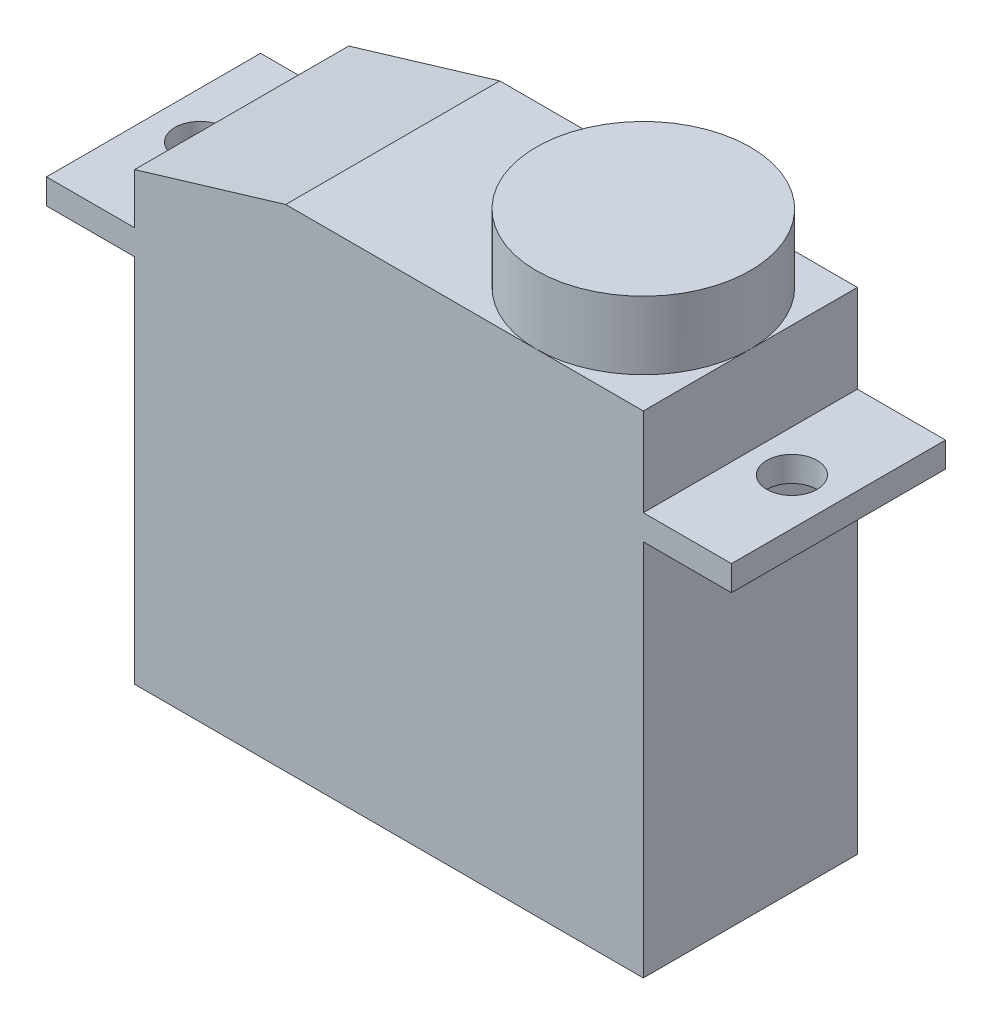
ISO-10303-21;
HEADER;
FILE_DESCRIPTION(('STEP AP214'),'2;1');
FILE_NAME('part.step','',(''),(''),'','','');
FILE_SCHEMA(('AUTOMOTIVE_DESIGN { 1 0 10303 214 1 1 1 1 }'));
ENDSEC;
DATA;
#1=APPLICATION_CONTEXT('core data for automotive mechanical design processes');
#2=APPLICATION_PROTOCOL_DEFINITION('international standard','automotive_design',2000,#1);
#3=PRODUCT_CONTEXT('',#1,'mechanical');
#4=PRODUCT('Part','Part','',(#3));
#5=PRODUCT_RELATED_PRODUCT_CATEGORY('part','',(#4));
#6=PRODUCT_DEFINITION_FORMATION('','',#4);
#7=PRODUCT_DEFINITION_CONTEXT('part definition',#1,'design');
#8=PRODUCT_DEFINITION('design','',#6,#7);
#9=PRODUCT_DEFINITION_SHAPE('','',#8);
#10=(LENGTH_UNIT() NAMED_UNIT(*) SI_UNIT(.MILLI.,.METRE.));
#11=(NAMED_UNIT(*) PLANE_ANGLE_UNIT() SI_UNIT($,.RADIAN.));
#12=(NAMED_UNIT(*) SI_UNIT($,.STERADIAN.) SOLID_ANGLE_UNIT());
#13=UNCERTAINTY_MEASURE_WITH_UNIT(LENGTH_MEASURE(1.E-05),#10,'distance_accuracy_value','');
#14=(GEOMETRIC_REPRESENTATION_CONTEXT(3) GLOBAL_UNCERTAINTY_ASSIGNED_CONTEXT((#13)) GLOBAL_UNIT_ASSIGNED_CONTEXT((#10,
#11,#12)) REPRESENTATION_CONTEXT('',''));
#15=CARTESIAN_POINT('',(0.,0.,0.));
#16=DIRECTION('',(0.,0.,1.));
#17=DIRECTION('',(1.,0.,0.));
#18=AXIS2_PLACEMENT_3D('',#15,#16,#17);
#19=CARTESIAN_POINT('',(-14.2,19.5,8.5));
#20=DIRECTION('',(0.,-1.,0.));
#21=DIRECTION('',(0.,0.,-1.));
#22=AXIS2_PLACEMENT_3D('',#19,#20,#21);
#23=PLANE('',#22);
#24=CARTESIAN_POINT('',(-4.25,19.5,4.25));
#25=DIRECTION('',(0.,1.,0.));
#26=DIRECTION('',(0.,0.,1.));
#27=AXIS2_PLACEMENT_3D('',#24,#25,#26);
#28=CIRCLE('',#27,4.25);
#29=CARTESIAN_POINT('',(-4.25,19.5,8.5));
#30=VERTEX_POINT('',#29);
#31=CARTESIAN_POINT('',(0.,19.5,4.25));
#32=VERTEX_POINT('',#31);
#33=EDGE_CURVE('E45',#30,#32,#28,.T.);
#34=ORIENTED_EDGE('',*,*,#33,.F.);
#35=DIRECTION('',(-1.,0.,0.));
#36=VECTOR('',#35,1.);
#37=CARTESIAN_POINT('',(-14.2,19.5,8.5));
#38=LINE('',#37,#36);
#39=CARTESIAN_POINT('',(0.,19.5,8.5));
#40=VERTEX_POINT('',#39);
#41=EDGE_CURVE('E139',#40,#30,#38,.T.);
#42=ORIENTED_EDGE('',*,*,#41,.F.);
#43=DIRECTION('',(0.,0.,-1.));
#44=VECTOR('',#43,1.);
#45=CARTESIAN_POINT('',(0.,19.5,8.5));
#46=LINE('',#45,#44);
#47=EDGE_CURVE('E157',#40,#32,#46,.T.);
#48=ORIENTED_EDGE('',*,*,#47,.T.);
#49=EDGE_LOOP('',(#34,#42,#48));
#50=FACE_BOUND('',#49,.T.);
#51=ADVANCED_FACE('F34',(#50),#23,.F.);
#52=CARTESIAN_POINT('',(-4.25,19.5,0.));
#53=VERTEX_POINT('',#52);
#54=EDGE_CURVE('E11',#32,#53,#28,.T.);
#55=ORIENTED_EDGE('',*,*,#54,.F.);
#56=CARTESIAN_POINT('',(0.,19.5,0.));
#57=VERTEX_POINT('',#56);
#58=EDGE_CURVE('E242',#32,#57,#46,.T.);
#59=ORIENTED_EDGE('',*,*,#58,.T.);
#60=DIRECTION('',(-1.,0.,0.));
#61=VECTOR('',#60,1.);
#62=CARTESIAN_POINT('',(-14.2,19.5,0.));
#63=LINE('',#62,#61);
#64=EDGE_CURVE('E206',#57,#53,#63,.T.);
#65=ORIENTED_EDGE('',*,*,#64,.T.);
#66=EDGE_LOOP('',(#55,#59,#65));
#67=FACE_BOUND('',#66,.T.);
#68=ADVANCED_FACE('F279',(#67),#23,.F.);
#69=EDGE_CURVE('E43',#53,#30,#28,.T.);
#70=ORIENTED_EDGE('',*,*,#69,.F.);
#71=CARTESIAN_POINT('',(-14.2,19.5,0.));
#72=VERTEX_POINT('',#71);
#73=EDGE_CURVE('E205',#53,#72,#63,.T.);
#74=ORIENTED_EDGE('',*,*,#73,.T.);
#75=DIRECTION('',(0.,0.,-1.));
#76=VECTOR('',#75,1.);
#77=CARTESIAN_POINT('',(-14.2,19.5,8.5));
#78=LINE('',#77,#76);
#79=CARTESIAN_POINT('',(-14.2,19.5,8.5));
#80=VERTEX_POINT('',#79);
#81=EDGE_CURVE('E154',#80,#72,#78,.T.);
#82=ORIENTED_EDGE('',*,*,#81,.F.);
#83=EDGE_CURVE('E142',#30,#80,#38,.T.);
#84=ORIENTED_EDGE('',*,*,#83,.F.);
#85=EDGE_LOOP('',(#70,#74,#82,#84));
#86=FACE_BOUND('',#85,.T.);
#87=ADVANCED_FACE('F152',(#86),#23,.F.);
#88=CARTESIAN_POINT('',(0.,0.,8.5));
#89=DIRECTION('',(-1.,0.,0.));
#90=DIRECTION('',(0.,0.,1.));
#91=AXIS2_PLACEMENT_3D('',#88,#89,#90);
#92=PLANE('',#91);
#93=DIRECTION('',(0.,1.,0.));
#94=VECTOR('',#93,1.);
#95=CARTESIAN_POINT('',(0.,0.,0.));
#96=LINE('',#95,#94);
#97=CARTESIAN_POINT('',(0.,0.,0.));
#98=VERTEX_POINT('',#97);
#99=CARTESIAN_POINT('',(0.,15.,0.));
#100=VERTEX_POINT('',#99);
#101=EDGE_CURVE('E193',#98,#100,#96,.T.);
#102=ORIENTED_EDGE('',*,*,#101,.T.);
#103=DIRECTION('',(0.,0.,-1.));
#104=VECTOR('',#103,1.);
#105=CARTESIAN_POINT('',(0.,15.,8.5));
#106=LINE('',#105,#104);
#107=CARTESIAN_POINT('',(0.,15.,8.5));
#108=VERTEX_POINT('',#107);
#109=EDGE_CURVE('E162',#108,#100,#106,.T.);
#110=ORIENTED_EDGE('',*,*,#109,.F.);
#111=DIRECTION('',(0.,1.,0.));
#112=VECTOR('',#111,1.);
#113=CARTESIAN_POINT('',(0.,0.,8.5));
#114=LINE('',#113,#112);
#115=CARTESIAN_POINT('',(0.,0.,8.5));
#116=VERTEX_POINT('',#115);
#117=EDGE_CURVE('E169',#116,#108,#114,.T.);
#118=ORIENTED_EDGE('',*,*,#117,.F.);
#119=DIRECTION('',(0.,0.,-1.));
#120=VECTOR('',#119,1.);
#121=CARTESIAN_POINT('',(0.,0.,8.5));
#122=LINE('',#121,#120);
#123=EDGE_CURVE('E192',#116,#98,#122,.T.);
#124=ORIENTED_EDGE('',*,*,#123,.T.);
#125=EDGE_LOOP('',(#102,#110,#118,#124));
#126=FACE_BOUND('',#125,.T.);
#127=ADVANCED_FACE('F36',(#126),#92,.F.);
#128=CARTESIAN_POINT('',(0.,15.,8.5));
#129=DIRECTION('',(0.,1.,0.));
#130=DIRECTION('',(0.,0.,1.));
#131=AXIS2_PLACEMENT_3D('',#128,#129,#130);
#132=PLANE('',#131);
#133=CARTESIAN_POINT('',(1.65,15.,4.25));
#134=DIRECTION('',(0.,1.,0.));
#135=DIRECTION('',(0.,0.,1.));
#136=AXIS2_PLACEMENT_3D('',#133,#134,#135);
#137=CIRCLE('',#136,0.999999999999998);
#138=CARTESIAN_POINT('',(1.65,15.,5.25));
#139=VERTEX_POINT('',#138);
#140=EDGE_CURVE('E253',#139,#139,#137,.T.);
#141=ORIENTED_EDGE('',*,*,#140,.T.);
#142=EDGE_LOOP('',(#141));
#143=FACE_BOUND('',#142,.T.);
#144=DIRECTION('',(1.,0.,0.));
#145=VECTOR('',#144,1.);
#146=CARTESIAN_POINT('',(0.,15.,0.));
#147=LINE('',#146,#145);
#148=CARTESIAN_POINT('',(3.5,15.,0.));
#149=VERTEX_POINT('',#148);
#150=EDGE_CURVE('E196',#100,#149,#147,.T.);
#151=ORIENTED_EDGE('',*,*,#150,.T.);
#152=DIRECTION('',(0.,0.,-1.));
#153=VECTOR('',#152,1.);
#154=CARTESIAN_POINT('',(3.5,15.,8.5));
#155=LINE('',#154,#153);
#156=CARTESIAN_POINT('',(3.5,15.,8.5));
#157=VERTEX_POINT('',#156);
#158=EDGE_CURVE('E164',#157,#149,#155,.T.);
#159=ORIENTED_EDGE('',*,*,#158,.F.);
#160=DIRECTION('',(1.,0.,0.));
#161=VECTOR('',#160,1.);
#162=CARTESIAN_POINT('',(0.,15.,8.5));
#163=LINE('',#162,#161);
#164=EDGE_CURVE('E171',#108,#157,#163,.T.);
#165=ORIENTED_EDGE('',*,*,#164,.F.);
#166=ORIENTED_EDGE('',*,*,#109,.T.);
#167=EDGE_LOOP('',(#151,#159,#165,#166));
#168=FACE_BOUND('',#167,.T.);
#169=ADVANCED_FACE('F290',(#143,#168),#132,.F.);
#170=CARTESIAN_POINT('',(3.5,15.,8.5));
#171=DIRECTION('',(-1.,0.,0.));
#172=DIRECTION('',(0.,-1.,0.));
#173=AXIS2_PLACEMENT_3D('',#170,#171,#172);
#174=PLANE('',#173);
#175=DIRECTION('',(0.,1.,0.));
#176=VECTOR('',#175,1.);
#177=CARTESIAN_POINT('',(3.5,15.,0.));
#178=LINE('',#177,#176);
#179=CARTESIAN_POINT('',(3.5,16.,0.));
#180=VERTEX_POINT('',#179);
#181=EDGE_CURVE('E198',#149,#180,#178,.T.);
#182=ORIENTED_EDGE('',*,*,#181,.T.);
#183=DIRECTION('',(0.,0.,-1.));
#184=VECTOR('',#183,1.);
#185=CARTESIAN_POINT('',(3.5,16.,8.5));
#186=LINE('',#185,#184);
#187=CARTESIAN_POINT('',(3.5,16.,8.5));
#188=VERTEX_POINT('',#187);
#189=EDGE_CURVE('E247',#188,#180,#186,.T.);
#190=ORIENTED_EDGE('',*,*,#189,.F.);
#191=DIRECTION('',(0.,1.,0.));
#192=VECTOR('',#191,1.);
#193=CARTESIAN_POINT('',(3.5,15.,8.5));
#194=LINE('',#193,#192);
#195=EDGE_CURVE('E174',#157,#188,#194,.T.);
#196=ORIENTED_EDGE('',*,*,#195,.F.);
#197=ORIENTED_EDGE('',*,*,#158,.T.);
#198=EDGE_LOOP('',(#182,#190,#196,#197));
#199=FACE_BOUND('',#198,.T.);
#200=ADVANCED_FACE('F295',(#199),#174,.F.);
#201=CARTESIAN_POINT('',(3.5,16.,8.5));
#202=DIRECTION('',(0.,-1.,0.));
#203=DIRECTION('',(0.,0.,-1.));
#204=AXIS2_PLACEMENT_3D('',#201,#202,#203);
#205=PLANE('',#204);
#206=CARTESIAN_POINT('',(1.65,16.,4.25));
#207=DIRECTION('',(0.,-1.,0.));
#208=DIRECTION('',(0.,0.,-1.));
#209=AXIS2_PLACEMENT_3D('',#206,#207,#208);
#210=CIRCLE('',#209,0.999999999999998);
#211=CARTESIAN_POINT('',(1.65,16.,3.25));
#212=VERTEX_POINT('',#211);
#213=EDGE_CURVE('E38',#212,#212,#210,.T.);
#214=ORIENTED_EDGE('',*,*,#213,.T.);
#215=EDGE_LOOP('',(#214));
#216=FACE_BOUND('',#215,.T.);
#217=DIRECTION('',(-1.,0.,0.));
#218=VECTOR('',#217,1.);
#219=CARTESIAN_POINT('',(3.5,16.,0.));
#220=LINE('',#219,#218);
#221=CARTESIAN_POINT('',(0.,16.,0.));
#222=VERTEX_POINT('',#221);
#223=EDGE_CURVE('E200',#180,#222,#220,.T.);
#224=ORIENTED_EDGE('',*,*,#223,.T.);
#225=DIRECTION('',(0.,0.,-1.));
#226=VECTOR('',#225,1.);
#227=CARTESIAN_POINT('',(0.,16.,8.5));
#228=LINE('',#227,#226);
#229=CARTESIAN_POINT('',(0.,16.,8.5));
#230=VERTEX_POINT('',#229);
#231=EDGE_CURVE('E244',#230,#222,#228,.T.);
#232=ORIENTED_EDGE('',*,*,#231,.F.);
#233=DIRECTION('',(-1.,0.,0.));
#234=VECTOR('',#233,1.);
#235=CARTESIAN_POINT('',(3.5,16.,8.5));
#236=LINE('',#235,#234);
#237=EDGE_CURVE('E176',#188,#230,#236,.T.);
#238=ORIENTED_EDGE('',*,*,#237,.F.);
#239=ORIENTED_EDGE('',*,*,#189,.T.);
#240=EDGE_LOOP('',(#224,#232,#238,#239));
#241=FACE_BOUND('',#240,.T.);
#242=ADVANCED_FACE('F264',(#216,#241),#205,.F.);
#243=CARTESIAN_POINT('',(0.,16.,8.5));
#244=DIRECTION('',(-1.,0.,0.));
#245=DIRECTION('',(0.,-1.,0.));
#246=AXIS2_PLACEMENT_3D('',#243,#244,#245);
#247=PLANE('',#246);
#248=DIRECTION('',(0.,1.,0.));
#249=VECTOR('',#248,1.);
#250=CARTESIAN_POINT('',(0.,16.,0.));
#251=LINE('',#250,#249);
#252=EDGE_CURVE('E202',#222,#57,#251,.T.);
#253=ORIENTED_EDGE('',*,*,#252,.T.);
#254=ORIENTED_EDGE('',*,*,#58,.F.);
#255=ORIENTED_EDGE('',*,*,#47,.F.);
#256=DIRECTION('',(0.,1.,0.));
#257=VECTOR('',#256,1.);
#258=CARTESIAN_POINT('',(0.,16.,8.5));
#259=LINE('',#258,#257);
#260=EDGE_CURVE('E145',#230,#40,#259,.T.);
#261=ORIENTED_EDGE('',*,*,#260,.F.);
#262=ORIENTED_EDGE('',*,*,#231,.T.);
#263=EDGE_LOOP('',(#253,#254,#255,#261,#262));
#264=FACE_BOUND('',#263,.T.);
#265=ADVANCED_FACE('F341',(#264),#247,.F.);
#266=CARTESIAN_POINT('',(-20.2,17.7,8.5));
#267=DIRECTION('',(0.287347885566346,-0.957826285221151,0.));
#268=DIRECTION('',(0.957826285221151,0.287347885566346,0.));
#269=AXIS2_PLACEMENT_3D('',#266,#267,#268);
#270=PLANE('',#269);
#271=DIRECTION('',(-0.957826285221151,-0.287347885566346,0.));
#272=VECTOR('',#271,1.);
#273=CARTESIAN_POINT('',(-20.2,17.7,0.));
#274=LINE('',#273,#272);
#275=CARTESIAN_POINT('',(-20.2,17.7,0.));
#276=VERTEX_POINT('',#275);
#277=EDGE_CURVE('E208',#72,#276,#274,.T.);
#278=ORIENTED_EDGE('',*,*,#277,.T.);
#279=DIRECTION('',(0.,0.,-1.));
#280=VECTOR('',#279,1.);
#281=CARTESIAN_POINT('',(-20.2,17.7,8.5));
#282=LINE('',#281,#280);
#283=CARTESIAN_POINT('',(-20.2,17.7,8.5));
#284=VERTEX_POINT('',#283);
#285=EDGE_CURVE('E238',#284,#276,#282,.T.);
#286=ORIENTED_EDGE('',*,*,#285,.F.);
#287=DIRECTION('',(-0.957826285221151,-0.287347885566346,0.));
#288=VECTOR('',#287,1.);
#289=CARTESIAN_POINT('',(-20.2,17.7,8.5));
#290=LINE('',#289,#288);
#291=EDGE_CURVE('E150',#80,#284,#290,.T.);
#292=ORIENTED_EDGE('',*,*,#291,.F.);
#293=ORIENTED_EDGE('',*,*,#81,.T.);
#294=EDGE_LOOP('',(#278,#286,#292,#293));
#295=FACE_BOUND('',#294,.T.);
#296=ADVANCED_FACE('F339',(#295),#270,.F.);
#297=CARTESIAN_POINT('',(-20.2,15.7,8.5));
#298=DIRECTION('',(1.,0.,0.));
#299=DIRECTION('',(0.,0.,-1.));
#300=AXIS2_PLACEMENT_3D('',#297,#298,#299);
#301=PLANE('',#300);
#302=DIRECTION('',(0.,-1.,0.));
#303=VECTOR('',#302,1.);
#304=CARTESIAN_POINT('',(-20.2,15.7,0.));
#305=LINE('',#304,#303);
#306=CARTESIAN_POINT('',(-20.2,15.7,0.));
#307=VERTEX_POINT('',#306);
#308=EDGE_CURVE('E210',#276,#307,#305,.T.);
#309=ORIENTED_EDGE('',*,*,#308,.T.);
#310=DIRECTION('',(0.,0.,-1.));
#311=VECTOR('',#310,1.);
#312=CARTESIAN_POINT('',(-20.2,15.7,8.5));
#313=LINE('',#312,#311);
#314=CARTESIAN_POINT('',(-20.2,15.7,8.5));
#315=VERTEX_POINT('',#314);
#316=EDGE_CURVE('E235',#315,#307,#313,.T.);
#317=ORIENTED_EDGE('',*,*,#316,.F.);
#318=DIRECTION('',(0.,-1.,0.));
#319=VECTOR('',#318,1.);
#320=CARTESIAN_POINT('',(-20.2,15.7,8.5));
#321=LINE('',#320,#319);
#322=EDGE_CURVE('E180',#284,#315,#321,.T.);
#323=ORIENTED_EDGE('',*,*,#322,.F.);
#324=ORIENTED_EDGE('',*,*,#285,.T.);
#325=EDGE_LOOP('',(#309,#317,#323,#324));
#326=FACE_BOUND('',#325,.T.);
#327=ADVANCED_FACE('F335',(#326),#301,.F.);
#328=CARTESIAN_POINT('',(-23.7,15.7,8.5));
#329=DIRECTION('',(0.,-1.,0.));
#330=DIRECTION('',(0.,0.,-1.));
#331=AXIS2_PLACEMENT_3D('',#328,#329,#330);
#332=PLANE('',#331);
#333=CARTESIAN_POINT('',(-21.85,15.7,4.25));
#334=DIRECTION('',(0.,-1.,0.));
#335=DIRECTION('',(0.,0.,-1.));
#336=AXIS2_PLACEMENT_3D('',#333,#334,#335);
#337=CIRCLE('',#336,0.999999999999998);
#338=CARTESIAN_POINT('',(-21.85,15.7,3.25));
#339=VERTEX_POINT('',#338);
#340=EDGE_CURVE('E160',#339,#339,#337,.T.);
#341=ORIENTED_EDGE('',*,*,#340,.T.);
#342=EDGE_LOOP('',(#341));
#343=FACE_BOUND('',#342,.T.);
#344=DIRECTION('',(-1.,0.,0.));
#345=VECTOR('',#344,1.);
#346=CARTESIAN_POINT('',(-23.7,15.7,0.));
#347=LINE('',#346,#345);
#348=CARTESIAN_POINT('',(-23.7,15.7,0.));
#349=VERTEX_POINT('',#348);
#350=EDGE_CURVE('E212',#307,#349,#347,.T.);
#351=ORIENTED_EDGE('',*,*,#350,.T.);
#352=DIRECTION('',(0.,0.,-1.));
#353=VECTOR('',#352,1.);
#354=CARTESIAN_POINT('',(-23.7,15.7,8.5));
#355=LINE('',#354,#353);
#356=CARTESIAN_POINT('',(-23.7,15.7,8.5));
#357=VERTEX_POINT('',#356);
#358=EDGE_CURVE('E232',#357,#349,#355,.T.);
#359=ORIENTED_EDGE('',*,*,#358,.F.);
#360=DIRECTION('',(-1.,0.,0.));
#361=VECTOR('',#360,1.);
#362=CARTESIAN_POINT('',(-23.7,15.7,8.5));
#363=LINE('',#362,#361);
#364=EDGE_CURVE('E182',#315,#357,#363,.T.);
#365=ORIENTED_EDGE('',*,*,#364,.F.);
#366=ORIENTED_EDGE('',*,*,#316,.T.);
#367=EDGE_LOOP('',(#351,#359,#365,#366));
#368=FACE_BOUND('',#367,.T.);
#369=ADVANCED_FACE('F330',(#343,#368),#332,.F.);
#370=CARTESIAN_POINT('',(-23.7,14.7,8.5));
#371=DIRECTION('',(1.,0.,0.));
#372=DIRECTION('',(0.,0.,-1.));
#373=AXIS2_PLACEMENT_3D('',#370,#371,#372);
#374=PLANE('',#373);
#375=DIRECTION('',(0.,-1.,0.));
#376=VECTOR('',#375,1.);
#377=CARTESIAN_POINT('',(-23.7,14.7,0.));
#378=LINE('',#377,#376);
#379=CARTESIAN_POINT('',(-23.7,14.7,0.));
#380=VERTEX_POINT('',#379);
#381=EDGE_CURVE('E214',#349,#380,#378,.T.);
#382=ORIENTED_EDGE('',*,*,#381,.T.);
#383=DIRECTION('',(0.,0.,-1.));
#384=VECTOR('',#383,1.);
#385=CARTESIAN_POINT('',(-23.7,14.7,8.5));
#386=LINE('',#385,#384);
#387=CARTESIAN_POINT('',(-23.7,14.7,8.5));
#388=VERTEX_POINT('',#387);
#389=EDGE_CURVE('E229',#388,#380,#386,.T.);
#390=ORIENTED_EDGE('',*,*,#389,.F.);
#391=DIRECTION('',(0.,-1.,0.));
#392=VECTOR('',#391,1.);
#393=CARTESIAN_POINT('',(-23.7,14.7,8.5));
#394=LINE('',#393,#392);
#395=EDGE_CURVE('E184',#357,#388,#394,.T.);
#396=ORIENTED_EDGE('',*,*,#395,.F.);
#397=ORIENTED_EDGE('',*,*,#358,.T.);
#398=EDGE_LOOP('',(#382,#390,#396,#397));
#399=FACE_BOUND('',#398,.T.);
#400=ADVANCED_FACE('F326',(#399),#374,.F.);
#401=CARTESIAN_POINT('',(-20.2,14.7,8.5));
#402=DIRECTION('',(0.,1.,0.));
#403=DIRECTION('',(-1.,0.,0.));
#404=AXIS2_PLACEMENT_3D('',#401,#402,#403);
#405=PLANE('',#404);
#406=CARTESIAN_POINT('',(-21.85,14.7,4.25));
#407=DIRECTION('',(0.,1.,0.));
#408=DIRECTION('',(-1.,0.,0.));
#409=AXIS2_PLACEMENT_3D('',#406,#407,#408);
#410=CIRCLE('',#409,0.999999999999998);
#411=CARTESIAN_POINT('',(-22.85,14.7,4.25));
#412=VERTEX_POINT('',#411);
#413=EDGE_CURVE('E251',#412,#412,#410,.T.);
#414=ORIENTED_EDGE('',*,*,#413,.T.);
#415=EDGE_LOOP('',(#414));
#416=FACE_BOUND('',#415,.T.);
#417=DIRECTION('',(1.,0.,0.));
#418=VECTOR('',#417,1.);
#419=CARTESIAN_POINT('',(-20.2,14.7,0.));
#420=LINE('',#419,#418);
#421=CARTESIAN_POINT('',(-20.2,14.7,0.));
#422=VERTEX_POINT('',#421);
#423=EDGE_CURVE('E216',#380,#422,#420,.T.);
#424=ORIENTED_EDGE('',*,*,#423,.T.);
#425=DIRECTION('',(0.,0.,-1.));
#426=VECTOR('',#425,1.);
#427=CARTESIAN_POINT('',(-20.2,14.7,8.5));
#428=LINE('',#427,#426);
#429=CARTESIAN_POINT('',(-20.2,14.7,8.5));
#430=VERTEX_POINT('',#429);
#431=EDGE_CURVE('E226',#430,#422,#428,.T.);
#432=ORIENTED_EDGE('',*,*,#431,.F.);
#433=DIRECTION('',(1.,0.,0.));
#434=VECTOR('',#433,1.);
#435=CARTESIAN_POINT('',(-20.2,14.7,8.5));
#436=LINE('',#435,#434);
#437=EDGE_CURVE('E186',#388,#430,#436,.T.);
#438=ORIENTED_EDGE('',*,*,#437,.F.);
#439=ORIENTED_EDGE('',*,*,#389,.T.);
#440=EDGE_LOOP('',(#424,#432,#438,#439));
#441=FACE_BOUND('',#440,.T.);
#442=ADVANCED_FACE('F321',(#416,#441),#405,.F.);
#443=CARTESIAN_POINT('',(-20.2,0.,8.5));
#444=DIRECTION('',(1.,0.,0.));
#445=DIRECTION('',(0.,0.,-1.));
#446=AXIS2_PLACEMENT_3D('',#443,#444,#445);
#447=PLANE('',#446);
#448=DIRECTION('',(0.,-1.,0.));
#449=VECTOR('',#448,1.);
#450=CARTESIAN_POINT('',(-20.2,0.,0.));
#451=LINE('',#450,#449);
#452=CARTESIAN_POINT('',(-20.2,0.,0.));
#453=VERTEX_POINT('',#452);
#454=EDGE_CURVE('E218',#422,#453,#451,.T.);
#455=ORIENTED_EDGE('',*,*,#454,.T.);
#456=DIRECTION('',(0.,0.,-1.));
#457=VECTOR('',#456,1.);
#458=CARTESIAN_POINT('',(-20.2,0.,8.5));
#459=LINE('',#458,#457);
#460=CARTESIAN_POINT('',(-20.2,0.,8.5));
#461=VERTEX_POINT('',#460);
#462=EDGE_CURVE('E223',#461,#453,#459,.T.);
#463=ORIENTED_EDGE('',*,*,#462,.F.);
#464=DIRECTION('',(0.,-1.,0.));
#465=VECTOR('',#464,1.);
#466=CARTESIAN_POINT('',(-20.2,0.,8.5));
#467=LINE('',#466,#465);
#468=EDGE_CURVE('E188',#430,#461,#467,.T.);
#469=ORIENTED_EDGE('',*,*,#468,.F.);
#470=ORIENTED_EDGE('',*,*,#431,.T.);
#471=EDGE_LOOP('',(#455,#463,#469,#470));
#472=FACE_BOUND('',#471,.T.);
#473=ADVANCED_FACE('F315',(#472),#447,.F.);
#474=CARTESIAN_POINT('',(0.,0.,8.5));
#475=DIRECTION('',(0.,1.,0.));
#476=DIRECTION('',(-1.,0.,0.));
#477=AXIS2_PLACEMENT_3D('',#474,#475,#476);
#478=PLANE('',#477);
#479=DIRECTION('',(1.,0.,0.));
#480=VECTOR('',#479,1.);
#481=CARTESIAN_POINT('',(0.,0.,0.));
#482=LINE('',#481,#480);
#483=EDGE_CURVE('E172',#453,#98,#482,.T.);
#484=ORIENTED_EDGE('',*,*,#483,.T.);
#485=ORIENTED_EDGE('',*,*,#123,.F.);
#486=DIRECTION('',(1.,0.,0.));
#487=VECTOR('',#486,1.);
#488=CARTESIAN_POINT('',(0.,0.,8.5));
#489=LINE('',#488,#487);
#490=EDGE_CURVE('E190',#461,#116,#489,.T.);
#491=ORIENTED_EDGE('',*,*,#490,.F.);
#492=ORIENTED_EDGE('',*,*,#462,.T.);
#493=EDGE_LOOP('',(#484,#485,#491,#492));
#494=FACE_BOUND('',#493,.T.);
#495=ADVANCED_FACE('F313',(#494),#478,.F.);
#496=CARTESIAN_POINT('',(0.,0.,8.5));
#497=DIRECTION('',(0.,0.,-1.));
#498=DIRECTION('',(-1.,0.,0.));
#499=AXIS2_PLACEMENT_3D('',#496,#497,#498);
#500=PLANE('',#499);
#501=ORIENTED_EDGE('',*,*,#117,.T.);
#502=ORIENTED_EDGE('',*,*,#164,.T.);
#503=ORIENTED_EDGE('',*,*,#195,.T.);
#504=ORIENTED_EDGE('',*,*,#237,.T.);
#505=ORIENTED_EDGE('',*,*,#260,.T.);
#506=ORIENTED_EDGE('',*,*,#41,.T.);
#507=ORIENTED_EDGE('',*,*,#83,.T.);
#508=ORIENTED_EDGE('',*,*,#291,.T.);
#509=ORIENTED_EDGE('',*,*,#322,.T.);
#510=ORIENTED_EDGE('',*,*,#364,.T.);
#511=ORIENTED_EDGE('',*,*,#395,.T.);
#512=ORIENTED_EDGE('',*,*,#437,.T.);
#513=ORIENTED_EDGE('',*,*,#468,.T.);
#514=ORIENTED_EDGE('',*,*,#490,.T.);
#515=EDGE_LOOP('',(#501,#502,#503,#504,#505,#506,#507,#508,#509,#510,#511,#512,#513,#514));
#516=FACE_BOUND('',#515,.T.);
#517=ADVANCED_FACE('F141',(#516),#500,.F.);
#518=CARTESIAN_POINT('',(0.,0.,0.));
#519=DIRECTION('',(0.,0.,-1.));
#520=DIRECTION('',(-1.,0.,0.));
#521=AXIS2_PLACEMENT_3D('',#518,#519,#520);
#522=PLANE('',#521);
#523=ORIENTED_EDGE('',*,*,#101,.F.);
#524=ORIENTED_EDGE('',*,*,#483,.F.);
#525=ORIENTED_EDGE('',*,*,#454,.F.);
#526=ORIENTED_EDGE('',*,*,#423,.F.);
#527=ORIENTED_EDGE('',*,*,#381,.F.);
#528=ORIENTED_EDGE('',*,*,#350,.F.);
#529=ORIENTED_EDGE('',*,*,#308,.F.);
#530=ORIENTED_EDGE('',*,*,#277,.F.);
#531=ORIENTED_EDGE('',*,*,#73,.F.);
#532=ORIENTED_EDGE('',*,*,#64,.F.);
#533=ORIENTED_EDGE('',*,*,#252,.F.);
#534=ORIENTED_EDGE('',*,*,#223,.F.);
#535=ORIENTED_EDGE('',*,*,#181,.F.);
#536=ORIENTED_EDGE('',*,*,#150,.F.);
#537=EDGE_LOOP('',(#523,#524,#525,#526,#527,#528,#529,#530,#531,#532,#533,#534,#535,#536));
#538=FACE_BOUND('',#537,.T.);
#539=ADVANCED_FACE('F302',(#538),#522,.T.);
#540=CARTESIAN_POINT('',(-4.25,22.2,4.25));
#541=DIRECTION('',(0.,-1.,0.));
#542=DIRECTION('',(0.,0.,-1.));
#543=AXIS2_PLACEMENT_3D('',#540,#541,#542);
#544=CYLINDRICAL_SURFACE('',#543,4.25);
#545=CARTESIAN_POINT('',(-4.25,22.2,4.25));
#546=DIRECTION('',(0.,1.,0.));
#547=DIRECTION('',(0.,0.,1.));
#548=AXIS2_PLACEMENT_3D('',#545,#546,#547);
#549=CIRCLE('',#548,4.25);
#550=CARTESIAN_POINT('',(-4.25,22.2,8.5));
#551=VERTEX_POINT('',#550);
#552=EDGE_CURVE('E159',#551,#551,#549,.T.);
#553=ORIENTED_EDGE('',*,*,#552,.F.);
#554=EDGE_LOOP('',(#553));
#555=FACE_BOUND('',#554,.T.);
#556=ORIENTED_EDGE('',*,*,#33,.T.);
#557=ORIENTED_EDGE('',*,*,#54,.T.);
#558=ORIENTED_EDGE('',*,*,#69,.T.);
#559=EDGE_LOOP('',(#556,#557,#558));
#560=FACE_BOUND('',#559,.T.);
#561=ADVANCED_FACE('F161',(#555,#560),#544,.T.);
#562=CARTESIAN_POINT('',(-4.25,22.2,4.25));
#563=DIRECTION('',(0.,1.,0.));
#564=DIRECTION('',(0.,0.,1.));
#565=AXIS2_PLACEMENT_3D('',#562,#563,#564);
#566=PLANE('',#565);
#567=ORIENTED_EDGE('',*,*,#552,.T.);
#568=EDGE_LOOP('',(#567));
#569=FACE_BOUND('',#568,.T.);
#570=ADVANCED_FACE('F275',(#569),#566,.T.);
#571=CARTESIAN_POINT('',(-21.85,0.,4.25));
#572=DIRECTION('',(0.,1.,0.));
#573=DIRECTION('',(0.,0.,1.));
#574=AXIS2_PLACEMENT_3D('',#571,#572,#573);
#575=CYLINDRICAL_SURFACE('',#574,0.999999999999998);
#576=ORIENTED_EDGE('',*,*,#413,.F.);
#577=EDGE_LOOP('',(#576));
#578=FACE_BOUND('',#577,.T.);
#579=ORIENTED_EDGE('',*,*,#340,.F.);
#580=EDGE_LOOP('',(#579));
#581=FACE_BOUND('',#580,.T.);
#582=ADVANCED_FACE('F270',(#578,#581),#575,.F.);
#583=CARTESIAN_POINT('',(1.65,0.,4.25));
#584=DIRECTION('',(0.,1.,0.));
#585=DIRECTION('',(0.,0.,1.));
#586=AXIS2_PLACEMENT_3D('',#583,#584,#585);
#587=CYLINDRICAL_SURFACE('',#586,0.999999999999998);
#588=ORIENTED_EDGE('',*,*,#213,.F.);
#589=EDGE_LOOP('',(#588));
#590=FACE_BOUND('',#589,.T.);
#591=ORIENTED_EDGE('',*,*,#140,.F.);
#592=EDGE_LOOP('',(#591));
#593=FACE_BOUND('',#592,.T.);
#594=ADVANCED_FACE('F267',(#590,#593),#587,.F.);
#595=CLOSED_SHELL('',(#51,#68,#87,#127,#169,#200,#242,#265,#296,#327,#369,#400,#442,#473,#495,
#517,#539,#561,#570,#582,#594));
#596=MANIFOLD_SOLID_BREP('B2',#595);
#597=ADVANCED_BREP_SHAPE_REPRESENTATION('',(#18,#596),#14);
#598=SHAPE_DEFINITION_REPRESENTATION(#9,#597);
ENDSEC;
END-ISO-10303-21;
